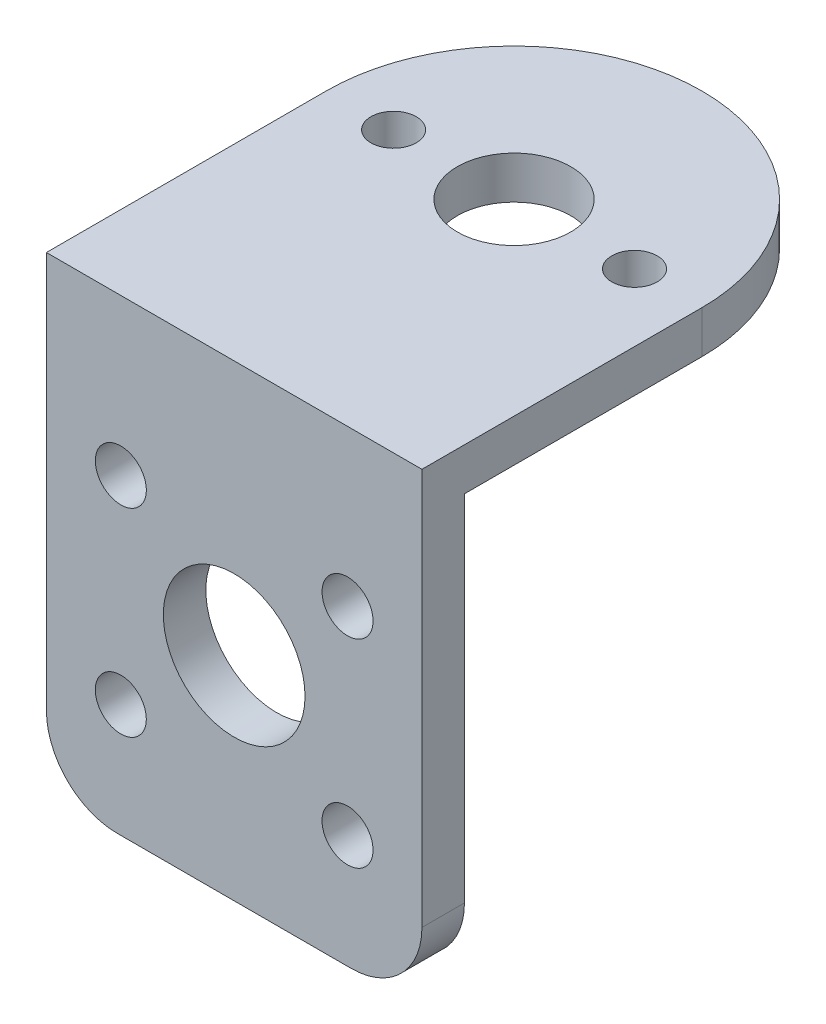
ISO-10303-21;
HEADER;
FILE_DESCRIPTION(('STEP AP214'),'2;1');
FILE_NAME('part.step','',(''),(''),'','','');
FILE_SCHEMA(('AUTOMOTIVE_DESIGN { 1 0 10303 214 1 1 1 1 }'));
ENDSEC;
DATA;
#1=APPLICATION_CONTEXT('core data for automotive mechanical design processes');
#2=APPLICATION_PROTOCOL_DEFINITION('international standard','automotive_design',2000,#1);
#3=PRODUCT_CONTEXT('',#1,'mechanical');
#4=PRODUCT('Part','Part','',(#3));
#5=PRODUCT_RELATED_PRODUCT_CATEGORY('part','',(#4));
#6=PRODUCT_DEFINITION_FORMATION('','',#4);
#7=PRODUCT_DEFINITION_CONTEXT('part definition',#1,'design');
#8=PRODUCT_DEFINITION('design','',#6,#7);
#9=PRODUCT_DEFINITION_SHAPE('','',#8);
#10=(LENGTH_UNIT() NAMED_UNIT(*) SI_UNIT(.MILLI.,.METRE.));
#11=(NAMED_UNIT(*) PLANE_ANGLE_UNIT() SI_UNIT($,.RADIAN.));
#12=(NAMED_UNIT(*) SI_UNIT($,.STERADIAN.) SOLID_ANGLE_UNIT());
#13=UNCERTAINTY_MEASURE_WITH_UNIT(LENGTH_MEASURE(1.E-05),#10,'distance_accuracy_value','');
#14=(GEOMETRIC_REPRESENTATION_CONTEXT(3) GLOBAL_UNCERTAINTY_ASSIGNED_CONTEXT((#13)) GLOBAL_UNIT_ASSIGNED_CONTEXT((#10,
#11,#12)) REPRESENTATION_CONTEXT('',''));
#15=CARTESIAN_POINT('',(0.,0.,0.));
#16=DIRECTION('',(0.,0.,1.));
#17=DIRECTION('',(1.,0.,0.));
#18=AXIS2_PLACEMENT_3D('',#15,#16,#17);
#19=CARTESIAN_POINT('',(5.,5.,3.));
#20=DIRECTION('',(0.,0.,-1.));
#21=DIRECTION('',(-1.,0.,0.));
#22=AXIS2_PLACEMENT_3D('',#19,#20,#21);
#23=PLANE('',#22);
#24=DIRECTION('',(0.,1.,0.));
#25=VECTOR('',#24,1.);
#26=CARTESIAN_POINT('',(26.5,5.00000000000004,3.));
#27=LINE('',#26,#25);
#28=CARTESIAN_POINT('',(26.5,5.00000000000004,3.));
#29=VERTEX_POINT('',#28);
#30=CARTESIAN_POINT('',(26.5,33.,3.));
#31=VERTEX_POINT('',#30);
#32=EDGE_CURVE('E115',#29,#31,#27,.T.);
#33=ORIENTED_EDGE('',*,*,#32,.T.);
#34=DIRECTION('',(1.,0.,0.));
#35=VECTOR('',#34,1.);
#36=CARTESIAN_POINT('',(0.,33.,3.));
#37=LINE('',#36,#35);
#38=CARTESIAN_POINT('',(0.,33.,3.));
#39=VERTEX_POINT('',#38);
#40=EDGE_CURVE('E118',#39,#31,#37,.T.);
#41=ORIENTED_EDGE('',*,*,#40,.F.);
#42=DIRECTION('',(0.,-1.,0.));
#43=VECTOR('',#42,1.);
#44=CARTESIAN_POINT('',(0.,5.00000000000004,3.));
#45=LINE('',#44,#43);
#46=CARTESIAN_POINT('',(0.,5.00000000000004,3.));
#47=VERTEX_POINT('',#46);
#48=EDGE_CURVE('E87',#39,#47,#45,.T.);
#49=ORIENTED_EDGE('',*,*,#48,.T.);
#50=CARTESIAN_POINT('',(5.,5.,3.));
#51=DIRECTION('',(0.,0.,1.));
#52=DIRECTION('',(-1.,0.,0.));
#53=AXIS2_PLACEMENT_3D('',#50,#51,#52);
#54=CIRCLE('',#53,5.);
#55=CARTESIAN_POINT('',(5.00000000000004,0.,3.));
#56=VERTEX_POINT('',#55);
#57=EDGE_CURVE('E114',#47,#56,#54,.T.);
#58=ORIENTED_EDGE('',*,*,#57,.T.);
#59=DIRECTION('',(1.,0.,0.));
#60=VECTOR('',#59,1.);
#61=CARTESIAN_POINT('',(5.00000000000004,0.,3.));
#62=LINE('',#61,#60);
#63=CARTESIAN_POINT('',(21.5,0.,3.));
#64=VERTEX_POINT('',#63);
#65=EDGE_CURVE('E183',#56,#64,#62,.T.);
#66=ORIENTED_EDGE('',*,*,#65,.T.);
#67=CARTESIAN_POINT('',(21.5,5.,3.));
#68=DIRECTION('',(0.,0.,1.));
#69=DIRECTION('',(-1.,0.,0.));
#70=AXIS2_PLACEMENT_3D('',#67,#68,#69);
#71=CIRCLE('',#70,5.);
#72=EDGE_CURVE('E53',#64,#29,#71,.T.);
#73=ORIENTED_EDGE('',*,*,#72,.T.);
#74=EDGE_LOOP('',(#33,#41,#49,#58,#66,#73));
#75=FACE_BOUND('',#74,.T.);
#76=CARTESIAN_POINT('',(13.25,15.,3.));
#77=DIRECTION('',(0.,0.,1.));
#78=DIRECTION('',(1.,0.,0.));
#79=AXIS2_PLACEMENT_3D('',#76,#77,#78);
#80=CIRCLE('',#79,5.);
#81=CARTESIAN_POINT('',(18.25,15.,3.));
#82=VERTEX_POINT('',#81);
#83=EDGE_CURVE('E175',#82,#82,#80,.T.);
#84=ORIENTED_EDGE('',*,*,#83,.F.);
#85=EDGE_LOOP('',(#84));
#86=FACE_BOUND('',#85,.T.);
#87=CARTESIAN_POINT('',(5.25,8.,3.));
#88=DIRECTION('',(0.,0.,1.));
#89=DIRECTION('',(1.,0.,0.));
#90=AXIS2_PLACEMENT_3D('',#87,#88,#89);
#91=CIRCLE('',#90,1.8);
#92=CARTESIAN_POINT('',(7.05,8.,3.));
#93=VERTEX_POINT('',#92);
#94=EDGE_CURVE('E169',#93,#93,#91,.T.);
#95=ORIENTED_EDGE('',*,*,#94,.F.);
#96=EDGE_LOOP('',(#95));
#97=FACE_BOUND('',#96,.T.);
#98=CARTESIAN_POINT('',(5.25,22.,3.));
#99=DIRECTION('',(0.,0.,1.));
#100=DIRECTION('',(-1.,0.,0.));
#101=AXIS2_PLACEMENT_3D('',#98,#99,#100);
#102=CIRCLE('',#101,1.8);
#103=CARTESIAN_POINT('',(3.45,22.,3.));
#104=VERTEX_POINT('',#103);
#105=EDGE_CURVE('E163',#104,#104,#102,.T.);
#106=ORIENTED_EDGE('',*,*,#105,.F.);
#107=EDGE_LOOP('',(#106));
#108=FACE_BOUND('',#107,.T.);
#109=CARTESIAN_POINT('',(21.25,8.,3.));
#110=DIRECTION('',(0.,0.,1.));
#111=DIRECTION('',(-1.,0.,0.));
#112=AXIS2_PLACEMENT_3D('',#109,#110,#111);
#113=CIRCLE('',#112,1.8);
#114=CARTESIAN_POINT('',(19.45,8.,3.));
#115=VERTEX_POINT('',#114);
#116=EDGE_CURVE('E157',#115,#115,#113,.T.);
#117=ORIENTED_EDGE('',*,*,#116,.F.);
#118=EDGE_LOOP('',(#117));
#119=FACE_BOUND('',#118,.T.);
#120=CARTESIAN_POINT('',(21.25,22.,3.));
#121=DIRECTION('',(0.,0.,1.));
#122=DIRECTION('',(1.,0.,0.));
#123=AXIS2_PLACEMENT_3D('',#120,#121,#122);
#124=CIRCLE('',#123,1.8);
#125=CARTESIAN_POINT('',(23.05,22.,3.));
#126=VERTEX_POINT('',#125);
#127=EDGE_CURVE('E151',#126,#126,#124,.T.);
#128=ORIENTED_EDGE('',*,*,#127,.F.);
#129=EDGE_LOOP('',(#128));
#130=FACE_BOUND('',#129,.T.);
#131=ADVANCED_FACE('F36',(#75,#86,#97,#108,#119,#130),#23,.F.);
#132=CARTESIAN_POINT('',(5.,5.,0.));
#133=DIRECTION('',(0.,0.,-1.));
#134=DIRECTION('',(-1.,0.,0.));
#135=AXIS2_PLACEMENT_3D('',#132,#133,#134);
#136=PLANE('',#135);
#137=CARTESIAN_POINT('',(21.25,8.,0.));
#138=DIRECTION('',(0.,0.,1.));
#139=DIRECTION('',(-1.,0.,0.));
#140=AXIS2_PLACEMENT_3D('',#137,#138,#139);
#141=CIRCLE('',#140,1.8);
#142=CARTESIAN_POINT('',(19.45,8.,0.));
#143=VERTEX_POINT('',#142);
#144=EDGE_CURVE('E154',#143,#143,#141,.T.);
#145=ORIENTED_EDGE('',*,*,#144,.T.);
#146=EDGE_LOOP('',(#145));
#147=FACE_BOUND('',#146,.T.);
#148=CARTESIAN_POINT('',(5.25,8.,0.));
#149=DIRECTION('',(0.,0.,1.));
#150=DIRECTION('',(1.,0.,0.));
#151=AXIS2_PLACEMENT_3D('',#148,#149,#150);
#152=CIRCLE('',#151,1.8);
#153=CARTESIAN_POINT('',(7.05,8.,0.));
#154=VERTEX_POINT('',#153);
#155=EDGE_CURVE('E166',#154,#154,#152,.T.);
#156=ORIENTED_EDGE('',*,*,#155,.T.);
#157=EDGE_LOOP('',(#156));
#158=FACE_BOUND('',#157,.T.);
#159=DIRECTION('',(0.,1.,0.));
#160=VECTOR('',#159,1.);
#161=CARTESIAN_POINT('',(26.5,5.00000000000004,0.));
#162=LINE('',#161,#160);
#163=CARTESIAN_POINT('',(26.5,5.00000000000004,0.));
#164=VERTEX_POINT('',#163);
#165=CARTESIAN_POINT('',(26.5,30.,0.));
#166=VERTEX_POINT('',#165);
#167=EDGE_CURVE('E178',#164,#166,#162,.T.);
#168=ORIENTED_EDGE('',*,*,#167,.F.);
#169=CARTESIAN_POINT('',(21.5,5.,0.));
#170=DIRECTION('',(0.,0.,1.));
#171=DIRECTION('',(-1.,0.,0.));
#172=AXIS2_PLACEMENT_3D('',#169,#170,#171);
#173=CIRCLE('',#172,5.);
#174=CARTESIAN_POINT('',(21.5,0.,0.));
#175=VERTEX_POINT('',#174);
#176=EDGE_CURVE('E80',#175,#164,#173,.T.);
#177=ORIENTED_EDGE('',*,*,#176,.F.);
#178=DIRECTION('',(1.,0.,0.));
#179=VECTOR('',#178,1.);
#180=CARTESIAN_POINT('',(5.00000000000004,0.,0.));
#181=LINE('',#180,#179);
#182=CARTESIAN_POINT('',(5.00000000000004,0.,0.));
#183=VERTEX_POINT('',#182);
#184=EDGE_CURVE('E74',#183,#175,#181,.T.);
#185=ORIENTED_EDGE('',*,*,#184,.F.);
#186=CARTESIAN_POINT('',(5.,5.,0.));
#187=DIRECTION('',(0.,0.,1.));
#188=DIRECTION('',(-1.,0.,0.));
#189=AXIS2_PLACEMENT_3D('',#186,#187,#188);
#190=CIRCLE('',#189,5.);
#191=CARTESIAN_POINT('',(0.,5.00000000000004,0.));
#192=VERTEX_POINT('',#191);
#193=EDGE_CURVE('E194',#192,#183,#190,.T.);
#194=ORIENTED_EDGE('',*,*,#193,.F.);
#195=DIRECTION('',(0.,-1.,0.));
#196=VECTOR('',#195,1.);
#197=CARTESIAN_POINT('',(0.,5.00000000000004,0.));
#198=LINE('',#197,#196);
#199=CARTESIAN_POINT('',(0.,30.,0.));
#200=VERTEX_POINT('',#199);
#201=EDGE_CURVE('E192',#200,#192,#198,.T.);
#202=ORIENTED_EDGE('',*,*,#201,.F.);
#203=DIRECTION('',(-1.,0.,0.));
#204=VECTOR('',#203,1.);
#205=CARTESIAN_POINT('',(0.,30.,0.));
#206=LINE('',#205,#204);
#207=EDGE_CURVE('E189',#166,#200,#206,.T.);
#208=ORIENTED_EDGE('',*,*,#207,.F.);
#209=EDGE_LOOP('',(#168,#177,#185,#194,#202,#208));
#210=FACE_BOUND('',#209,.T.);
#211=CARTESIAN_POINT('',(13.25,15.,0.));
#212=DIRECTION('',(0.,0.,1.));
#213=DIRECTION('',(1.,0.,0.));
#214=AXIS2_PLACEMENT_3D('',#211,#212,#213);
#215=CIRCLE('',#214,5.);
#216=CARTESIAN_POINT('',(18.25,15.,0.));
#217=VERTEX_POINT('',#216);
#218=EDGE_CURVE('E172',#217,#217,#215,.T.);
#219=ORIENTED_EDGE('',*,*,#218,.T.);
#220=EDGE_LOOP('',(#219));
#221=FACE_BOUND('',#220,.T.);
#222=CARTESIAN_POINT('',(5.25,22.,0.));
#223=DIRECTION('',(0.,0.,1.));
#224=DIRECTION('',(-1.,0.,0.));
#225=AXIS2_PLACEMENT_3D('',#222,#223,#224);
#226=CIRCLE('',#225,1.8);
#227=CARTESIAN_POINT('',(3.45,22.,0.));
#228=VERTEX_POINT('',#227);
#229=EDGE_CURVE('E160',#228,#228,#226,.T.);
#230=ORIENTED_EDGE('',*,*,#229,.T.);
#231=EDGE_LOOP('',(#230));
#232=FACE_BOUND('',#231,.T.);
#233=CARTESIAN_POINT('',(21.25,22.,0.));
#234=DIRECTION('',(0.,0.,1.));
#235=DIRECTION('',(1.,0.,0.));
#236=AXIS2_PLACEMENT_3D('',#233,#234,#235);
#237=CIRCLE('',#236,1.8);
#238=CARTESIAN_POINT('',(23.05,22.,0.));
#239=VERTEX_POINT('',#238);
#240=EDGE_CURVE('E150',#239,#239,#237,.T.);
#241=ORIENTED_EDGE('',*,*,#240,.T.);
#242=EDGE_LOOP('',(#241));
#243=FACE_BOUND('',#242,.T.);
#244=ADVANCED_FACE('F207',(#147,#158,#210,#221,#232,#243),#136,.T.);
#245=CARTESIAN_POINT('',(26.5,5.00000000000004,3.));
#246=DIRECTION('',(-1.,0.,0.));
#247=DIRECTION('',(0.,0.,1.));
#248=AXIS2_PLACEMENT_3D('',#245,#246,#247);
#249=PLANE('',#248);
#250=ORIENTED_EDGE('',*,*,#167,.T.);
#251=DIRECTION('',(0.,0.,-1.));
#252=VECTOR('',#251,1.);
#253=CARTESIAN_POINT('',(26.5,30.,3.));
#254=LINE('',#253,#252);
#255=CARTESIAN_POINT('',(26.5,30.,-16.75));
#256=VERTEX_POINT('',#255);
#257=EDGE_CURVE('E132',#166,#256,#254,.T.);
#258=ORIENTED_EDGE('',*,*,#257,.T.);
#259=DIRECTION('',(0.,-1.,0.));
#260=VECTOR('',#259,1.);
#261=CARTESIAN_POINT('',(26.5,33.,-16.75));
#262=LINE('',#261,#260);
#263=CARTESIAN_POINT('',(26.5,33.,-16.75));
#264=VERTEX_POINT('',#263);
#265=EDGE_CURVE('E147',#264,#256,#262,.T.);
#266=ORIENTED_EDGE('',*,*,#265,.F.);
#267=DIRECTION('',(0.,0.,-1.));
#268=VECTOR('',#267,1.);
#269=CARTESIAN_POINT('',(26.5,33.,3.));
#270=LINE('',#269,#268);
#271=EDGE_CURVE('E123',#31,#264,#270,.T.);
#272=ORIENTED_EDGE('',*,*,#271,.F.);
#273=ORIENTED_EDGE('',*,*,#32,.F.);
#274=DIRECTION('',(0.,0.,-1.));
#275=VECTOR('',#274,1.);
#276=CARTESIAN_POINT('',(26.5,5.00000000000004,3.));
#277=LINE('',#276,#275);
#278=EDGE_CURVE('E186',#29,#164,#277,.T.);
#279=ORIENTED_EDGE('',*,*,#278,.T.);
#280=EDGE_LOOP('',(#250,#258,#266,#272,#273,#279));
#281=FACE_BOUND('',#280,.T.);
#282=ADVANCED_FACE('F38',(#281),#249,.F.);
#283=CARTESIAN_POINT('',(0.,5.00000000000004,3.));
#284=DIRECTION('',(1.,0.,0.));
#285=DIRECTION('',(0.,0.,-1.));
#286=AXIS2_PLACEMENT_3D('',#283,#284,#285);
#287=PLANE('',#286);
#288=ORIENTED_EDGE('',*,*,#201,.T.);
#289=DIRECTION('',(0.,0.,-1.));
#290=VECTOR('',#289,1.);
#291=CARTESIAN_POINT('',(0.,5.00000000000004,3.));
#292=LINE('',#291,#290);
#293=EDGE_CURVE('E11',#47,#192,#292,.T.);
#294=ORIENTED_EDGE('',*,*,#293,.F.);
#295=ORIENTED_EDGE('',*,*,#48,.F.);
#296=DIRECTION('',(0.,0.,1.));
#297=VECTOR('',#296,1.);
#298=CARTESIAN_POINT('',(0.,33.,3.));
#299=LINE('',#298,#297);
#300=CARTESIAN_POINT('',(0.,33.,-16.75));
#301=VERTEX_POINT('',#300);
#302=EDGE_CURVE('E112',#301,#39,#299,.T.);
#303=ORIENTED_EDGE('',*,*,#302,.F.);
#304=DIRECTION('',(0.,-1.,0.));
#305=VECTOR('',#304,1.);
#306=CARTESIAN_POINT('',(0.,33.,-16.75));
#307=LINE('',#306,#305);
#308=CARTESIAN_POINT('',(0.,30.,-16.75));
#309=VERTEX_POINT('',#308);
#310=EDGE_CURVE('E140',#301,#309,#307,.T.);
#311=ORIENTED_EDGE('',*,*,#310,.T.);
#312=DIRECTION('',(0.,0.,1.));
#313=VECTOR('',#312,1.);
#314=CARTESIAN_POINT('',(0.,30.,3.));
#315=LINE('',#314,#313);
#316=EDGE_CURVE('E141',#309,#200,#315,.T.);
#317=ORIENTED_EDGE('',*,*,#316,.T.);
#318=EDGE_LOOP('',(#288,#294,#295,#303,#311,#317));
#319=FACE_BOUND('',#318,.T.);
#320=ADVANCED_FACE('F109',(#319),#287,.F.);
#321=CARTESIAN_POINT('',(5.,5.,3.));
#322=DIRECTION('',(0.,0.,-1.));
#323=DIRECTION('',(-1.,0.,0.));
#324=AXIS2_PLACEMENT_3D('',#321,#322,#323);
#325=CYLINDRICAL_SURFACE('',#324,5.);
#326=ORIENTED_EDGE('',*,*,#193,.T.);
#327=DIRECTION('',(0.,0.,-1.));
#328=VECTOR('',#327,1.);
#329=CARTESIAN_POINT('',(5.00000000000004,0.,3.));
#330=LINE('',#329,#328);
#331=EDGE_CURVE('E45',#56,#183,#330,.T.);
#332=ORIENTED_EDGE('',*,*,#331,.F.);
#333=ORIENTED_EDGE('',*,*,#57,.F.);
#334=ORIENTED_EDGE('',*,*,#293,.T.);
#335=EDGE_LOOP('',(#326,#332,#333,#334));
#336=FACE_BOUND('',#335,.T.);
#337=ADVANCED_FACE('F218',(#336),#325,.T.);
#338=CARTESIAN_POINT('',(5.00000000000004,0.,3.));
#339=DIRECTION('',(0.,1.,0.));
#340=DIRECTION('',(0.,0.,1.));
#341=AXIS2_PLACEMENT_3D('',#338,#339,#340);
#342=PLANE('',#341);
#343=ORIENTED_EDGE('',*,*,#184,.T.);
#344=DIRECTION('',(0.,0.,-1.));
#345=VECTOR('',#344,1.);
#346=CARTESIAN_POINT('',(21.5,0.,3.));
#347=LINE('',#346,#345);
#348=EDGE_CURVE('E199',#64,#175,#347,.T.);
#349=ORIENTED_EDGE('',*,*,#348,.F.);
#350=ORIENTED_EDGE('',*,*,#65,.F.);
#351=ORIENTED_EDGE('',*,*,#331,.T.);
#352=EDGE_LOOP('',(#343,#349,#350,#351));
#353=FACE_BOUND('',#352,.T.);
#354=ADVANCED_FACE('F202',(#353),#342,.F.);
#355=CARTESIAN_POINT('',(21.5,5.,3.));
#356=DIRECTION('',(0.,0.,-1.));
#357=DIRECTION('',(-1.,0.,0.));
#358=AXIS2_PLACEMENT_3D('',#355,#356,#357);
#359=CYLINDRICAL_SURFACE('',#358,5.);
#360=ORIENTED_EDGE('',*,*,#176,.T.);
#361=ORIENTED_EDGE('',*,*,#278,.F.);
#362=ORIENTED_EDGE('',*,*,#72,.F.);
#363=ORIENTED_EDGE('',*,*,#348,.T.);
#364=EDGE_LOOP('',(#360,#361,#362,#363));
#365=FACE_BOUND('',#364,.T.);
#366=ADVANCED_FACE('F219',(#365),#359,.T.);
#367=CARTESIAN_POINT('',(13.25,15.,3.));
#368=DIRECTION('',(0.,0.,-1.));
#369=DIRECTION('',(-1.,0.,0.));
#370=AXIS2_PLACEMENT_3D('',#367,#368,#369);
#371=CYLINDRICAL_SURFACE('',#370,5.);
#372=ORIENTED_EDGE('',*,*,#83,.T.);
#373=EDGE_LOOP('',(#372));
#374=FACE_BOUND('',#373,.T.);
#375=ORIENTED_EDGE('',*,*,#218,.F.);
#376=EDGE_LOOP('',(#375));
#377=FACE_BOUND('',#376,.T.);
#378=ADVANCED_FACE('F221',(#374,#377),#371,.F.);
#379=CARTESIAN_POINT('',(5.25,8.,3.));
#380=DIRECTION('',(0.,0.,-1.));
#381=DIRECTION('',(-1.,0.,0.));
#382=AXIS2_PLACEMENT_3D('',#379,#380,#381);
#383=CYLINDRICAL_SURFACE('',#382,1.8);
#384=ORIENTED_EDGE('',*,*,#94,.T.);
#385=EDGE_LOOP('',(#384));
#386=FACE_BOUND('',#385,.T.);
#387=ORIENTED_EDGE('',*,*,#155,.F.);
#388=EDGE_LOOP('',(#387));
#389=FACE_BOUND('',#388,.T.);
#390=ADVANCED_FACE('F227',(#386,#389),#383,.F.);
#391=CARTESIAN_POINT('',(5.25,22.,3.));
#392=DIRECTION('',(0.,0.,-1.));
#393=DIRECTION('',(-1.,0.,0.));
#394=AXIS2_PLACEMENT_3D('',#391,#392,#393);
#395=CYLINDRICAL_SURFACE('',#394,1.8);
#396=ORIENTED_EDGE('',*,*,#105,.T.);
#397=EDGE_LOOP('',(#396));
#398=FACE_BOUND('',#397,.T.);
#399=ORIENTED_EDGE('',*,*,#229,.F.);
#400=EDGE_LOOP('',(#399));
#401=FACE_BOUND('',#400,.T.);
#402=ADVANCED_FACE('F241',(#398,#401),#395,.F.);
#403=CARTESIAN_POINT('',(21.25,8.,3.));
#404=DIRECTION('',(0.,0.,-1.));
#405=DIRECTION('',(-1.,0.,0.));
#406=AXIS2_PLACEMENT_3D('',#403,#404,#405);
#407=CYLINDRICAL_SURFACE('',#406,1.8);
#408=ORIENTED_EDGE('',*,*,#116,.T.);
#409=EDGE_LOOP('',(#408));
#410=FACE_BOUND('',#409,.T.);
#411=ORIENTED_EDGE('',*,*,#144,.F.);
#412=EDGE_LOOP('',(#411));
#413=FACE_BOUND('',#412,.T.);
#414=ADVANCED_FACE('F245',(#410,#413),#407,.F.);
#415=CARTESIAN_POINT('',(21.25,22.,3.));
#416=DIRECTION('',(0.,0.,-1.));
#417=DIRECTION('',(-1.,0.,0.));
#418=AXIS2_PLACEMENT_3D('',#415,#416,#417);
#419=CYLINDRICAL_SURFACE('',#418,1.8);
#420=ORIENTED_EDGE('',*,*,#127,.T.);
#421=EDGE_LOOP('',(#420));
#422=FACE_BOUND('',#421,.T.);
#423=ORIENTED_EDGE('',*,*,#240,.F.);
#424=EDGE_LOOP('',(#423));
#425=FACE_BOUND('',#424,.T.);
#426=ADVANCED_FACE('F249',(#422,#425),#419,.F.);
#427=CARTESIAN_POINT('',(13.25,30.,-16.75));
#428=DIRECTION('',(0.,1.,0.));
#429=DIRECTION('',(0.,0.,1.));
#430=AXIS2_PLACEMENT_3D('',#427,#428,#429);
#431=PLANE('',#430);
#432=CARTESIAN_POINT('',(13.25,30.,-16.75));
#433=DIRECTION('',(0.,1.,0.));
#434=DIRECTION('',(0.,0.,1.));
#435=AXIS2_PLACEMENT_3D('',#432,#433,#434);
#436=CIRCLE('',#435,4.);
#437=CARTESIAN_POINT('',(13.25,30.,-12.75));
#438=VERTEX_POINT('',#437);
#439=EDGE_CURVE('E135',#438,#438,#436,.T.);
#440=ORIENTED_EDGE('',*,*,#439,.T.);
#441=EDGE_LOOP('',(#440));
#442=FACE_BOUND('',#441,.T.);
#443=CARTESIAN_POINT('',(21.75,30.,-16.75));
#444=DIRECTION('',(0.,1.,0.));
#445=DIRECTION('',(0.,0.,1.));
#446=AXIS2_PLACEMENT_3D('',#443,#444,#445);
#447=CIRCLE('',#446,1.6);
#448=CARTESIAN_POINT('',(21.75,30.,-15.15));
#449=VERTEX_POINT('',#448);
#450=EDGE_CURVE('E284',#449,#449,#447,.T.);
#451=ORIENTED_EDGE('',*,*,#450,.T.);
#452=EDGE_LOOP('',(#451));
#453=FACE_BOUND('',#452,.T.);
#454=CARTESIAN_POINT('',(4.75,30.,-16.75));
#455=DIRECTION('',(0.,1.,0.));
#456=DIRECTION('',(0.,0.,1.));
#457=AXIS2_PLACEMENT_3D('',#454,#455,#456);
#458=CIRCLE('',#457,1.6);
#459=CARTESIAN_POINT('',(4.75,30.,-15.15));
#460=VERTEX_POINT('',#459);
#461=EDGE_CURVE('E281',#460,#460,#458,.T.);
#462=ORIENTED_EDGE('',*,*,#461,.T.);
#463=EDGE_LOOP('',(#462));
#464=FACE_BOUND('',#463,.T.);
#465=ORIENTED_EDGE('',*,*,#257,.F.);
#466=ORIENTED_EDGE('',*,*,#207,.T.);
#467=ORIENTED_EDGE('',*,*,#316,.F.);
#468=CARTESIAN_POINT('',(13.25,30.,-16.75));
#469=DIRECTION('',(0.,1.,0.));
#470=DIRECTION('',(0.,0.,1.));
#471=AXIS2_PLACEMENT_3D('',#468,#469,#470);
#472=CIRCLE('',#471,13.25);
#473=EDGE_CURVE('E130',#256,#309,#472,.T.);
#474=ORIENTED_EDGE('',*,*,#473,.F.);
#475=EDGE_LOOP('',(#465,#466,#467,#474));
#476=FACE_BOUND('',#475,.T.);
#477=ADVANCED_FACE('F214',(#442,#453,#464,#476),#431,.F.);
#478=CARTESIAN_POINT('',(13.25,33.,-16.75));
#479=DIRECTION('',(0.,1.,0.));
#480=DIRECTION('',(0.,0.,1.));
#481=AXIS2_PLACEMENT_3D('',#478,#479,#480);
#482=PLANE('',#481);
#483=CARTESIAN_POINT('',(21.75,33.,-16.75));
#484=DIRECTION('',(0.,1.,0.));
#485=DIRECTION('',(0.,0.,1.));
#486=AXIS2_PLACEMENT_3D('',#483,#484,#485);
#487=CIRCLE('',#486,1.6);
#488=CARTESIAN_POINT('',(21.75,33.,-15.15));
#489=VERTEX_POINT('',#488);
#490=EDGE_CURVE('E287',#489,#489,#487,.T.);
#491=ORIENTED_EDGE('',*,*,#490,.F.);
#492=EDGE_LOOP('',(#491));
#493=FACE_BOUND('',#492,.T.);
#494=ORIENTED_EDGE('',*,*,#302,.T.);
#495=ORIENTED_EDGE('',*,*,#40,.T.);
#496=ORIENTED_EDGE('',*,*,#271,.T.);
#497=CARTESIAN_POINT('',(13.25,33.,-16.75));
#498=DIRECTION('',(0.,1.,0.));
#499=DIRECTION('',(0.,0.,1.));
#500=AXIS2_PLACEMENT_3D('',#497,#498,#499);
#501=CIRCLE('',#500,13.25);
#502=EDGE_CURVE('E128',#264,#301,#501,.T.);
#503=ORIENTED_EDGE('',*,*,#502,.T.);
#504=EDGE_LOOP('',(#494,#495,#496,#503));
#505=FACE_BOUND('',#504,.T.);
#506=CARTESIAN_POINT('',(13.25,33.,-16.75));
#507=DIRECTION('',(0.,1.,0.));
#508=DIRECTION('',(0.,0.,1.));
#509=AXIS2_PLACEMENT_3D('',#506,#507,#508);
#510=CIRCLE('',#509,4.);
#511=CARTESIAN_POINT('',(13.25,33.,-12.75));
#512=VERTEX_POINT('',#511);
#513=EDGE_CURVE('E144',#512,#512,#510,.T.);
#514=ORIENTED_EDGE('',*,*,#513,.F.);
#515=EDGE_LOOP('',(#514));
#516=FACE_BOUND('',#515,.T.);
#517=CARTESIAN_POINT('',(4.75,33.,-16.75));
#518=DIRECTION('',(0.,1.,0.));
#519=DIRECTION('',(0.,0.,1.));
#520=AXIS2_PLACEMENT_3D('',#517,#518,#519);
#521=CIRCLE('',#520,1.6);
#522=CARTESIAN_POINT('',(4.75,33.,-15.15));
#523=VERTEX_POINT('',#522);
#524=EDGE_CURVE('E278',#523,#523,#521,.T.);
#525=ORIENTED_EDGE('',*,*,#524,.F.);
#526=EDGE_LOOP('',(#525));
#527=FACE_BOUND('',#526,.T.);
#528=ADVANCED_FACE('F125',(#493,#505,#516,#527),#482,.T.);
#529=CARTESIAN_POINT('',(13.25,33.,-16.75));
#530=DIRECTION('',(0.,-1.,0.));
#531=DIRECTION('',(0.,0.,-1.));
#532=AXIS2_PLACEMENT_3D('',#529,#530,#531);
#533=CYLINDRICAL_SURFACE('',#532,13.25);
#534=ORIENTED_EDGE('',*,*,#473,.T.);
#535=ORIENTED_EDGE('',*,*,#310,.F.);
#536=ORIENTED_EDGE('',*,*,#502,.F.);
#537=ORIENTED_EDGE('',*,*,#265,.T.);
#538=EDGE_LOOP('',(#534,#535,#536,#537));
#539=FACE_BOUND('',#538,.T.);
#540=ADVANCED_FACE('F217',(#539),#533,.T.);
#541=CARTESIAN_POINT('',(13.25,33.,-16.75));
#542=DIRECTION('',(0.,-1.,0.));
#543=DIRECTION('',(0.,0.,-1.));
#544=AXIS2_PLACEMENT_3D('',#541,#542,#543);
#545=CYLINDRICAL_SURFACE('',#544,4.);
#546=ORIENTED_EDGE('',*,*,#513,.T.);
#547=EDGE_LOOP('',(#546));
#548=FACE_BOUND('',#547,.T.);
#549=ORIENTED_EDGE('',*,*,#439,.F.);
#550=EDGE_LOOP('',(#549));
#551=FACE_BOUND('',#550,.T.);
#552=ADVANCED_FACE('F256',(#548,#551),#545,.F.);
#553=CARTESIAN_POINT('',(21.75,33.,-16.75));
#554=DIRECTION('',(0.,-1.,0.));
#555=DIRECTION('',(0.,0.,-1.));
#556=AXIS2_PLACEMENT_3D('',#553,#554,#555);
#557=CYLINDRICAL_SURFACE('',#556,1.6);
#558=ORIENTED_EDGE('',*,*,#490,.T.);
#559=EDGE_LOOP('',(#558));
#560=FACE_BOUND('',#559,.T.);
#561=ORIENTED_EDGE('',*,*,#450,.F.);
#562=EDGE_LOOP('',(#561));
#563=FACE_BOUND('',#562,.T.);
#564=ADVANCED_FACE('F265',(#560,#563),#557,.F.);
#565=CARTESIAN_POINT('',(4.75,33.,-16.75));
#566=DIRECTION('',(0.,-1.,0.));
#567=DIRECTION('',(0.,0.,-1.));
#568=AXIS2_PLACEMENT_3D('',#565,#566,#567);
#569=CYLINDRICAL_SURFACE('',#568,1.6);
#570=ORIENTED_EDGE('',*,*,#524,.T.);
#571=EDGE_LOOP('',(#570));
#572=FACE_BOUND('',#571,.T.);
#573=ORIENTED_EDGE('',*,*,#461,.F.);
#574=EDGE_LOOP('',(#573));
#575=FACE_BOUND('',#574,.T.);
#576=ADVANCED_FACE('F269',(#572,#575),#569,.F.);
#577=CLOSED_SHELL('',(#131,#244,#282,#320,#337,#354,#366,#378,#390,#402,#414,#426,#477,#528,
#540,#552,#564,#576));
#578=MANIFOLD_SOLID_BREP('B2',#577);
#579=ADVANCED_BREP_SHAPE_REPRESENTATION('',(#18,#578),#14);
#580=SHAPE_DEFINITION_REPRESENTATION(#9,#579);
ENDSEC;
END-ISO-10303-21;
